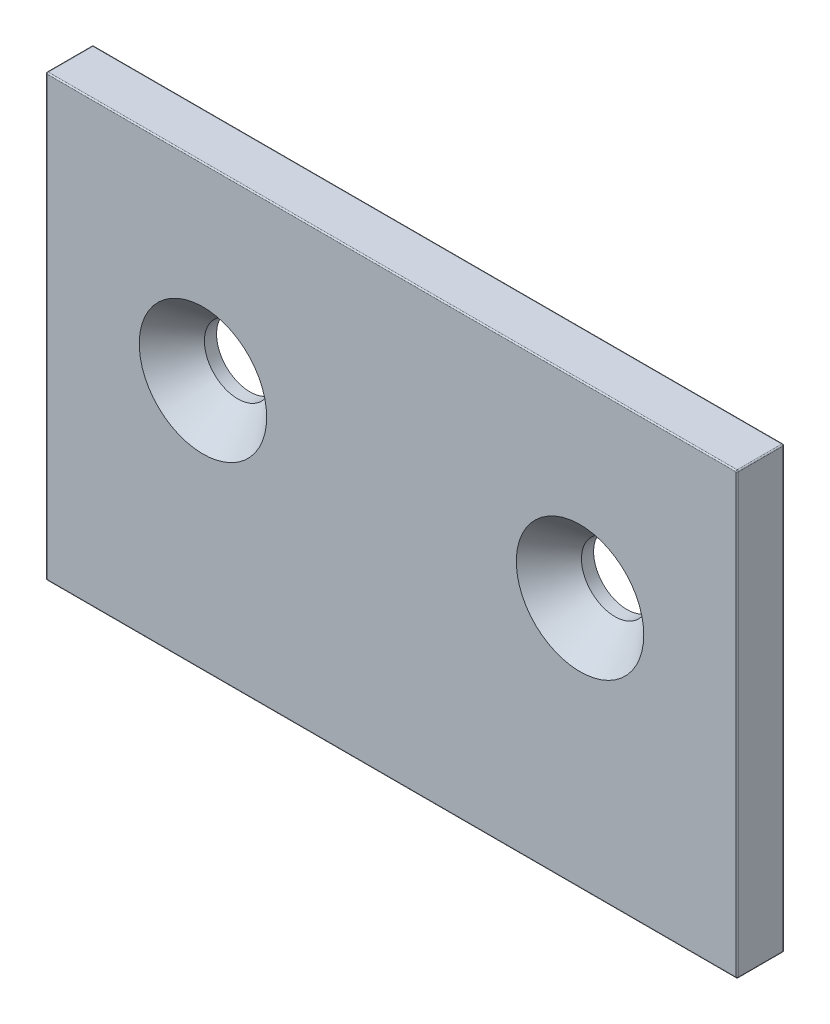
ISO-10303-21;
HEADER;
FILE_DESCRIPTION(('STEP AP214'),'2;1');
FILE_NAME('part.step','',(''),(''),'','','');
FILE_SCHEMA(('AUTOMOTIVE_DESIGN { 1 0 10303 214 1 1 1 1 }'));
ENDSEC;
DATA;
#1=APPLICATION_CONTEXT('core data for automotive mechanical design processes');
#2=APPLICATION_PROTOCOL_DEFINITION('international standard','automotive_design',2000,#1);
#3=PRODUCT_CONTEXT('',#1,'mechanical');
#4=PRODUCT('Part','Part','',(#3));
#5=PRODUCT_RELATED_PRODUCT_CATEGORY('part','',(#4));
#6=PRODUCT_DEFINITION_FORMATION('','',#4);
#7=PRODUCT_DEFINITION_CONTEXT('part definition',#1,'design');
#8=PRODUCT_DEFINITION('design','',#6,#7);
#9=PRODUCT_DEFINITION_SHAPE('','',#8);
#10=(LENGTH_UNIT() NAMED_UNIT(*) SI_UNIT(.MILLI.,.METRE.));
#11=(NAMED_UNIT(*) PLANE_ANGLE_UNIT() SI_UNIT($,.RADIAN.));
#12=(NAMED_UNIT(*) SI_UNIT($,.STERADIAN.) SOLID_ANGLE_UNIT());
#13=UNCERTAINTY_MEASURE_WITH_UNIT(LENGTH_MEASURE(1.E-05),#10,'distance_accuracy_value','');
#14=(GEOMETRIC_REPRESENTATION_CONTEXT(3) GLOBAL_UNCERTAINTY_ASSIGNED_CONTEXT((#13)) GLOBAL_UNIT_ASSIGNED_CONTEXT((#10,
#11,#12)) REPRESENTATION_CONTEXT('',''));
#15=CARTESIAN_POINT('',(0.,0.,0.));
#16=DIRECTION('',(0.,0.,1.));
#17=DIRECTION('',(1.,0.,0.));
#18=AXIS2_PLACEMENT_3D('',#15,#16,#17);
#19=CARTESIAN_POINT('',(34.925,0.,4.7498));
#20=DIRECTION('',(0.,-1.,0.));
#21=DIRECTION('',(1.,0.,0.));
#22=AXIS2_PLACEMENT_3D('',#19,#20,#21);
#23=PLANE('',#22);
#24=DIRECTION('',(-1.,0.,0.));
#25=VECTOR('',#24,1.);
#26=CARTESIAN_POINT('',(-34.925,0.,4.6228));
#27=LINE('',#26,#25);
#28=CARTESIAN_POINT('',(34.798,0.,4.6228));
#29=VERTEX_POINT('',#28);
#30=CARTESIAN_POINT('',(-34.798,0.,4.6228));
#31=VERTEX_POINT('',#30);
#32=EDGE_CURVE('E140',#29,#31,#27,.T.);
#33=ORIENTED_EDGE('',*,*,#32,.T.);
#34=DIRECTION('',(0.,0.,-1.));
#35=VECTOR('',#34,1.);
#36=CARTESIAN_POINT('',(-34.798,0.,4.7498));
#37=LINE('',#36,#35);
#38=CARTESIAN_POINT('',(-34.798,0.,0.127));
#39=VERTEX_POINT('',#38);
#40=EDGE_CURVE('E135',#31,#39,#37,.T.);
#41=ORIENTED_EDGE('',*,*,#40,.T.);
#42=DIRECTION('',(-1.,0.,0.));
#43=VECTOR('',#42,1.);
#44=CARTESIAN_POINT('',(34.925,0.,0.127));
#45=LINE('',#44,#43);
#46=CARTESIAN_POINT('',(34.798,0.,0.127));
#47=VERTEX_POINT('',#46);
#48=EDGE_CURVE('E128',#39,#47,#45,.F.);
#49=ORIENTED_EDGE('',*,*,#48,.T.);
#50=DIRECTION('',(0.,0.,-1.));
#51=VECTOR('',#50,1.);
#52=CARTESIAN_POINT('',(34.798,0.,4.7498));
#53=LINE('',#52,#51);
#54=EDGE_CURVE('E132',#47,#29,#53,.F.);
#55=ORIENTED_EDGE('',*,*,#54,.T.);
#56=EDGE_LOOP('',(#33,#41,#49,#55));
#57=FACE_BOUND('',#56,.T.);
#58=ADVANCED_FACE('F39',(#57),#23,.T.);
#59=CARTESIAN_POINT('',(34.925,0.,4.7498));
#60=DIRECTION('',(-1.,0.,0.));
#61=DIRECTION('',(0.,0.,1.));
#62=AXIS2_PLACEMENT_3D('',#59,#60,#61);
#63=PLANE('',#62);
#64=DIRECTION('',(0.,1.,0.));
#65=VECTOR('',#64,1.);
#66=CARTESIAN_POINT('',(34.925,0.,4.6228));
#67=LINE('',#66,#65);
#68=CARTESIAN_POINT('',(34.925,44.323,4.6228));
#69=VERTEX_POINT('',#68);
#70=CARTESIAN_POINT('',(34.925,0.126999999999993,4.6228));
#71=VERTEX_POINT('',#70);
#72=EDGE_CURVE('E49',#69,#71,#67,.F.);
#73=ORIENTED_EDGE('',*,*,#72,.T.);
#74=DIRECTION('',(0.,0.,-1.));
#75=VECTOR('',#74,1.);
#76=CARTESIAN_POINT('',(34.925,0.126999999999993,0.));
#77=LINE('',#76,#75);
#78=CARTESIAN_POINT('',(34.925,0.126999999999993,0.127));
#79=VERTEX_POINT('',#78);
#80=EDGE_CURVE('E11',#71,#79,#77,.T.);
#81=ORIENTED_EDGE('',*,*,#80,.T.);
#82=DIRECTION('',(0.,1.,0.));
#83=VECTOR('',#82,1.);
#84=CARTESIAN_POINT('',(34.925,44.45,0.127));
#85=LINE('',#84,#83);
#86=CARTESIAN_POINT('',(34.925,44.323,0.127));
#87=VERTEX_POINT('',#86);
#88=EDGE_CURVE('E231',#79,#87,#85,.T.);
#89=ORIENTED_EDGE('',*,*,#88,.T.);
#90=DIRECTION('',(0.,0.,-1.));
#91=VECTOR('',#90,1.);
#92=CARTESIAN_POINT('',(34.925,44.323,4.7498));
#93=LINE('',#92,#91);
#94=EDGE_CURVE('E60',#87,#69,#93,.F.);
#95=ORIENTED_EDGE('',*,*,#94,.T.);
#96=EDGE_LOOP('',(#73,#81,#89,#95));
#97=FACE_BOUND('',#96,.T.);
#98=ADVANCED_FACE('F366',(#97),#63,.F.);
#99=CARTESIAN_POINT('',(34.925,44.45,4.7498));
#100=DIRECTION('',(0.,-1.,0.));
#101=DIRECTION('',(0.,0.,-1.));
#102=AXIS2_PLACEMENT_3D('',#99,#100,#101);
#103=PLANE('',#102);
#104=DIRECTION('',(0.,0.,-1.));
#105=VECTOR('',#104,1.);
#106=CARTESIAN_POINT('',(-34.798,44.45,4.7498));
#107=LINE('',#106,#105);
#108=CARTESIAN_POINT('',(-34.798,44.45,0.127));
#109=VERTEX_POINT('',#108);
#110=CARTESIAN_POINT('',(-34.798,44.45,4.6228));
#111=VERTEX_POINT('',#110);
#112=EDGE_CURVE('E224',#109,#111,#107,.F.);
#113=ORIENTED_EDGE('',*,*,#112,.T.);
#114=DIRECTION('',(-1.,0.,0.));
#115=VECTOR('',#114,1.);
#116=CARTESIAN_POINT('',(34.925,44.45,4.6228));
#117=LINE('',#116,#115);
#118=CARTESIAN_POINT('',(34.798,44.45,4.6228));
#119=VERTEX_POINT('',#118);
#120=EDGE_CURVE('E227',#111,#119,#117,.F.);
#121=ORIENTED_EDGE('',*,*,#120,.T.);
#122=DIRECTION('',(0.,0.,-1.));
#123=VECTOR('',#122,1.);
#124=CARTESIAN_POINT('',(34.798,44.45,4.7498));
#125=LINE('',#124,#123);
#126=CARTESIAN_POINT('',(34.798,44.45,0.127));
#127=VERTEX_POINT('',#126);
#128=EDGE_CURVE('E218',#119,#127,#125,.T.);
#129=ORIENTED_EDGE('',*,*,#128,.T.);
#130=DIRECTION('',(-1.,0.,0.));
#131=VECTOR('',#130,1.);
#132=CARTESIAN_POINT('',(-34.925,44.45,0.127));
#133=LINE('',#132,#131);
#134=EDGE_CURVE('E221',#127,#109,#133,.T.);
#135=ORIENTED_EDGE('',*,*,#134,.T.);
#136=EDGE_LOOP('',(#113,#121,#129,#135));
#137=FACE_BOUND('',#136,.T.);
#138=ADVANCED_FACE('F360',(#137),#103,.F.);
#139=CARTESIAN_POINT('',(-34.925,0.,4.7498));
#140=DIRECTION('',(-1.,0.,0.));
#141=DIRECTION('',(0.,0.,1.));
#142=AXIS2_PLACEMENT_3D('',#139,#140,#141);
#143=PLANE('',#142);
#144=DIRECTION('',(0.,0.,-1.));
#145=VECTOR('',#144,1.);
#146=CARTESIAN_POINT('',(-34.925,0.127,4.7498));
#147=LINE('',#146,#145);
#148=CARTESIAN_POINT('',(-34.925,0.127,0.127));
#149=VERTEX_POINT('',#148);
#150=CARTESIAN_POINT('',(-34.925,0.127,4.6228));
#151=VERTEX_POINT('',#150);
#152=EDGE_CURVE('E211',#149,#151,#147,.F.);
#153=ORIENTED_EDGE('',*,*,#152,.T.);
#154=DIRECTION('',(0.,1.,0.));
#155=VECTOR('',#154,1.);
#156=CARTESIAN_POINT('',(-34.925,44.45,4.6228));
#157=LINE('',#156,#155);
#158=CARTESIAN_POINT('',(-34.925,44.323,4.6228));
#159=VERTEX_POINT('',#158);
#160=EDGE_CURVE('E214',#151,#159,#157,.T.);
#161=ORIENTED_EDGE('',*,*,#160,.T.);
#162=DIRECTION('',(0.,0.,-1.));
#163=VECTOR('',#162,1.);
#164=CARTESIAN_POINT('',(-34.925,44.323,0.));
#165=LINE('',#164,#163);
#166=CARTESIAN_POINT('',(-34.925,44.323,0.127));
#167=VERTEX_POINT('',#166);
#168=EDGE_CURVE('E205',#159,#167,#165,.T.);
#169=ORIENTED_EDGE('',*,*,#168,.T.);
#170=DIRECTION('',(0.,1.,0.));
#171=VECTOR('',#170,1.);
#172=CARTESIAN_POINT('',(-34.925,0.,0.127));
#173=LINE('',#172,#171);
#174=EDGE_CURVE('E208',#167,#149,#173,.F.);
#175=ORIENTED_EDGE('',*,*,#174,.T.);
#176=EDGE_LOOP('',(#153,#161,#169,#175));
#177=FACE_BOUND('',#176,.T.);
#178=ADVANCED_FACE('F351',(#177),#143,.T.);
#179=CARTESIAN_POINT('',(0.,0.,4.7498));
#180=DIRECTION('',(0.,0.,-1.));
#181=DIRECTION('',(-1.,0.,0.));
#182=AXIS2_PLACEMENT_3D('',#179,#180,#181);
#183=PLANE('',#182);
#184=DIRECTION('',(0.,1.,0.));
#185=VECTOR('',#184,1.);
#186=CARTESIAN_POINT('',(-34.798,0.,4.7498));
#187=LINE('',#186,#185);
#188=CARTESIAN_POINT('',(-34.798,44.323,4.7498));
#189=VERTEX_POINT('',#188);
#190=CARTESIAN_POINT('',(-34.798,0.127,4.7498));
#191=VERTEX_POINT('',#190);
#192=EDGE_CURVE('E187',#189,#191,#187,.F.);
#193=ORIENTED_EDGE('',*,*,#192,.T.);
#194=DIRECTION('',(-1.,0.,0.));
#195=VECTOR('',#194,1.);
#196=CARTESIAN_POINT('',(34.925,0.126999999999992,4.7498));
#197=LINE('',#196,#195);
#198=CARTESIAN_POINT('',(34.798,0.126999999999993,4.7498));
#199=VERTEX_POINT('',#198);
#200=EDGE_CURVE('E190',#191,#199,#197,.F.);
#201=ORIENTED_EDGE('',*,*,#200,.T.);
#202=DIRECTION('',(0.,1.,0.));
#203=VECTOR('',#202,1.);
#204=CARTESIAN_POINT('',(34.798,0.,4.7498));
#205=LINE('',#204,#203);
#206=CARTESIAN_POINT('',(34.798,44.323,4.7498));
#207=VERTEX_POINT('',#206);
#208=EDGE_CURVE('E181',#199,#207,#205,.T.);
#209=ORIENTED_EDGE('',*,*,#208,.T.);
#210=DIRECTION('',(-1.,0.,0.));
#211=VECTOR('',#210,1.);
#212=CARTESIAN_POINT('',(0.,44.323,4.7498));
#213=LINE('',#212,#211);
#214=EDGE_CURVE('E184',#207,#189,#213,.T.);
#215=ORIENTED_EDGE('',*,*,#214,.T.);
#216=EDGE_LOOP('',(#193,#201,#209,#215));
#217=FACE_BOUND('',#216,.T.);
#218=CARTESIAN_POINT('',(-19.05,25.4,4.7498));
#219=DIRECTION('',(0.,0.,1.));
#220=DIRECTION('',(1.,0.,0.));
#221=AXIS2_PLACEMENT_3D('',#218,#219,#220);
#222=CIRCLE('',#221,6.4389);
#223=CARTESIAN_POINT('',(-12.6111,25.4,4.7498));
#224=VERTEX_POINT('',#223);
#225=EDGE_CURVE('E313',#224,#224,#222,.T.);
#226=ORIENTED_EDGE('',*,*,#225,.F.);
#227=EDGE_LOOP('',(#226));
#228=FACE_BOUND('',#227,.T.);
#229=CARTESIAN_POINT('',(19.05,25.4,4.7498));
#230=DIRECTION('',(0.,0.,1.));
#231=DIRECTION('',(1.,0.,0.));
#232=AXIS2_PLACEMENT_3D('',#229,#230,#231);
#233=CIRCLE('',#232,6.4389);
#234=CARTESIAN_POINT('',(25.4889,25.4,4.7498));
#235=VERTEX_POINT('',#234);
#236=EDGE_CURVE('E332',#235,#235,#233,.T.);
#237=ORIENTED_EDGE('',*,*,#236,.F.);
#238=EDGE_LOOP('',(#237));
#239=FACE_BOUND('',#238,.T.);
#240=ADVANCED_FACE('F348',(#217,#228,#239),#183,.F.);
#241=CARTESIAN_POINT('',(0.,0.,0.));
#242=DIRECTION('',(0.,0.,-1.));
#243=DIRECTION('',(-1.,0.,0.));
#244=AXIS2_PLACEMENT_3D('',#241,#242,#243);
#245=PLANE('',#244);
#246=DIRECTION('',(0.,1.,0.));
#247=VECTOR('',#246,1.);
#248=CARTESIAN_POINT('',(34.798,0.,0.));
#249=LINE('',#248,#247);
#250=CARTESIAN_POINT('',(34.798,44.323,0.));
#251=VERTEX_POINT('',#250);
#252=CARTESIAN_POINT('',(34.798,0.126999999999992,0.));
#253=VERTEX_POINT('',#252);
#254=EDGE_CURVE('E194',#251,#253,#249,.F.);
#255=ORIENTED_EDGE('',*,*,#254,.T.);
#256=DIRECTION('',(-1.,0.,0.));
#257=VECTOR('',#256,1.);
#258=CARTESIAN_POINT('',(0.,0.126999999999996,0.));
#259=LINE('',#258,#257);
#260=CARTESIAN_POINT('',(-34.798,0.127,0.));
#261=VERTEX_POINT('',#260);
#262=EDGE_CURVE('E148',#253,#261,#259,.T.);
#263=ORIENTED_EDGE('',*,*,#262,.T.);
#264=DIRECTION('',(0.,1.,0.));
#265=VECTOR('',#264,1.);
#266=CARTESIAN_POINT('',(-34.798,0.,0.));
#267=LINE('',#266,#265);
#268=CARTESIAN_POINT('',(-34.798,44.323,0.));
#269=VERTEX_POINT('',#268);
#270=EDGE_CURVE('E200',#261,#269,#267,.T.);
#271=ORIENTED_EDGE('',*,*,#270,.T.);
#272=DIRECTION('',(-1.,0.,0.));
#273=VECTOR('',#272,1.);
#274=CARTESIAN_POINT('',(34.925,44.323,0.));
#275=LINE('',#274,#273);
#276=EDGE_CURVE('E197',#269,#251,#275,.F.);
#277=ORIENTED_EDGE('',*,*,#276,.T.);
#278=EDGE_LOOP('',(#255,#263,#271,#277));
#279=FACE_BOUND('',#278,.T.);
#280=CARTESIAN_POINT('',(-19.05,25.4,0.));
#281=DIRECTION('',(0.,0.,1.));
#282=DIRECTION('',(1.,0.,0.));
#283=AXIS2_PLACEMENT_3D('',#280,#281,#282);
#284=CIRCLE('',#283,3.3782);
#285=CARTESIAN_POINT('',(-15.6718,25.4,0.));
#286=VERTEX_POINT('',#285);
#287=EDGE_CURVE('E326',#286,#286,#284,.T.);
#288=ORIENTED_EDGE('',*,*,#287,.T.);
#289=EDGE_LOOP('',(#288));
#290=FACE_BOUND('',#289,.T.);
#291=CARTESIAN_POINT('',(19.05,25.4,0.));
#292=DIRECTION('',(0.,0.,1.));
#293=DIRECTION('',(1.,0.,0.));
#294=AXIS2_PLACEMENT_3D('',#291,#292,#293);
#295=CIRCLE('',#294,3.3782);
#296=CARTESIAN_POINT('',(22.4282,25.4,0.));
#297=VERTEX_POINT('',#296);
#298=EDGE_CURVE('E169',#297,#297,#295,.T.);
#299=ORIENTED_EDGE('',*,*,#298,.T.);
#300=EDGE_LOOP('',(#299));
#301=FACE_BOUND('',#300,.T.);
#302=ADVANCED_FACE('F350',(#279,#290,#301),#245,.T.);
#303=CARTESIAN_POINT('',(19.05,25.4,4.7498));
#304=DIRECTION('',(0.,0.,1.));
#305=DIRECTION('',(1.,0.,0.));
#306=AXIS2_PLACEMENT_3D('',#303,#304,#305);
#307=CYLINDRICAL_SURFACE('',#306,3.3782);
#308=ORIENTED_EDGE('',*,*,#298,.F.);
#309=EDGE_LOOP('',(#308));
#310=FACE_BOUND('',#309,.T.);
#311=CARTESIAN_POINT('',(19.05,25.4,1.22886741601866));
#312=DIRECTION('',(0.,0.,1.));
#313=DIRECTION('',(1.,0.,0.));
#314=AXIS2_PLACEMENT_3D('',#311,#312,#313);
#315=CIRCLE('',#314,3.3782);
#316=CARTESIAN_POINT('',(22.4282,25.4,1.22886741601866));
#317=VERTEX_POINT('',#316);
#318=EDGE_CURVE('E173',#317,#317,#315,.T.);
#319=ORIENTED_EDGE('',*,*,#318,.T.);
#320=EDGE_LOOP('',(#319));
#321=FACE_BOUND('',#320,.T.);
#322=ADVANCED_FACE('F339',(#310,#321),#307,.F.);
#323=CARTESIAN_POINT('',(19.05,25.4,4.7498));
#324=DIRECTION('',(0.,0.,1.));
#325=DIRECTION('',(1.,0.,0.));
#326=AXIS2_PLACEMENT_3D('',#323,#324,#325);
#327=CONICAL_SURFACE('',#326,6.4389,0.715584993317676);
#328=ORIENTED_EDGE('',*,*,#318,.F.);
#329=EDGE_LOOP('',(#328));
#330=FACE_BOUND('',#329,.T.);
#331=ORIENTED_EDGE('',*,*,#236,.T.);
#332=EDGE_LOOP('',(#331));
#333=FACE_BOUND('',#332,.T.);
#334=ADVANCED_FACE('F341',(#330,#333),#327,.F.);
#335=CARTESIAN_POINT('',(-19.05,25.4,4.7498));
#336=DIRECTION('',(0.,0.,1.));
#337=DIRECTION('',(1.,0.,0.));
#338=AXIS2_PLACEMENT_3D('',#335,#336,#337);
#339=CYLINDRICAL_SURFACE('',#338,3.3782);
#340=ORIENTED_EDGE('',*,*,#287,.F.);
#341=EDGE_LOOP('',(#340));
#342=FACE_BOUND('',#341,.T.);
#343=CARTESIAN_POINT('',(-19.05,25.4,1.22886741601866));
#344=DIRECTION('',(0.,0.,1.));
#345=DIRECTION('',(1.,0.,0.));
#346=AXIS2_PLACEMENT_3D('',#343,#344,#345);
#347=CIRCLE('',#346,3.3782);
#348=CARTESIAN_POINT('',(-15.6718,25.4,1.22886741601866));
#349=VERTEX_POINT('',#348);
#350=EDGE_CURVE('E320',#349,#349,#347,.T.);
#351=ORIENTED_EDGE('',*,*,#350,.T.);
#352=EDGE_LOOP('',(#351));
#353=FACE_BOUND('',#352,.T.);
#354=ADVANCED_FACE('F344',(#342,#353),#339,.F.);
#355=CARTESIAN_POINT('',(-19.05,25.4,4.7498));
#356=DIRECTION('',(0.,0.,1.));
#357=DIRECTION('',(1.,0.,0.));
#358=AXIS2_PLACEMENT_3D('',#355,#356,#357);
#359=CONICAL_SURFACE('',#358,6.4389,0.715584993317676);
#360=ORIENTED_EDGE('',*,*,#350,.F.);
#361=EDGE_LOOP('',(#360));
#362=FACE_BOUND('',#361,.T.);
#363=ORIENTED_EDGE('',*,*,#225,.T.);
#364=EDGE_LOOP('',(#363));
#365=FACE_BOUND('',#364,.T.);
#366=ADVANCED_FACE('F443',(#362,#365),#359,.F.);
#367=CARTESIAN_POINT('',(34.925,44.323,0.127));
#368=DIRECTION('',(1.,0.,0.));
#369=DIRECTION('',(0.,0.,-1.));
#370=AXIS2_PLACEMENT_3D('',#367,#368,#369);
#371=CYLINDRICAL_SURFACE('',#370,0.127);
#372=CARTESIAN_POINT('',(34.798,44.323,0.127));
#373=DIRECTION('',(1.,0.,0.));
#374=DIRECTION('',(0.,0.,-1.));
#375=AXIS2_PLACEMENT_3D('',#372,#373,#374);
#376=CIRCLE('',#375,0.127);
#377=EDGE_CURVE('E43',#251,#127,#376,.T.);
#378=ORIENTED_EDGE('',*,*,#377,.F.);
#379=ORIENTED_EDGE('',*,*,#276,.F.);
#380=CARTESIAN_POINT('',(-34.798,44.323,0.127));
#381=DIRECTION('',(-1.,0.,0.));
#382=DIRECTION('',(0.,0.,1.));
#383=AXIS2_PLACEMENT_3D('',#380,#381,#382);
#384=CIRCLE('',#383,0.127);
#385=EDGE_CURVE('E304',#109,#269,#384,.T.);
#386=ORIENTED_EDGE('',*,*,#385,.F.);
#387=ORIENTED_EDGE('',*,*,#134,.F.);
#388=EDGE_LOOP('',(#378,#379,#386,#387));
#389=FACE_BOUND('',#388,.T.);
#390=ADVANCED_FACE('F41',(#389),#371,.T.);
#391=CARTESIAN_POINT('',(34.798,44.323,0.127));
#392=DIRECTION('',(0.,1.,0.));
#393=DIRECTION('',(0.,0.,1.));
#394=AXIS2_PLACEMENT_3D('',#391,#392,#393);
#395=SPHERICAL_SURFACE('',#394,0.127);
#396=CARTESIAN_POINT('',(34.798,44.323,0.127));
#397=DIRECTION('',(0.,1.,0.));
#398=DIRECTION('',(0.,0.,1.));
#399=AXIS2_PLACEMENT_3D('',#396,#397,#398);
#400=CIRCLE('',#399,0.127);
#401=EDGE_CURVE('E297',#251,#87,#400,.F.);
#402=ORIENTED_EDGE('',*,*,#401,.F.);
#403=ORIENTED_EDGE('',*,*,#377,.T.);
#404=CARTESIAN_POINT('',(34.798,44.323,0.127));
#405=DIRECTION('',(0.,0.,-1.));
#406=DIRECTION('',(-1.,0.,0.));
#407=AXIS2_PLACEMENT_3D('',#404,#405,#406);
#408=CIRCLE('',#407,0.127);
#409=EDGE_CURVE('E301',#87,#127,#408,.F.);
#410=ORIENTED_EDGE('',*,*,#409,.F.);
#411=EDGE_LOOP('',(#402,#403,#410));
#412=FACE_BOUND('',#411,.T.);
#413=ADVANCED_FACE('F438',(#412),#395,.T.);
#414=CARTESIAN_POINT('',(-34.798,44.323,0.127));
#415=DIRECTION('',(0.,0.,-1.));
#416=DIRECTION('',(-1.,0.,0.));
#417=AXIS2_PLACEMENT_3D('',#414,#415,#416);
#418=SPHERICAL_SURFACE('',#417,0.127);
#419=CARTESIAN_POINT('',(-34.798,44.323,0.127));
#420=DIRECTION('',(0.,0.,-1.));
#421=DIRECTION('',(0.,1.,0.));
#422=AXIS2_PLACEMENT_3D('',#419,#420,#421);
#423=CIRCLE('',#422,0.127);
#424=EDGE_CURVE('E289',#109,#167,#423,.F.);
#425=ORIENTED_EDGE('',*,*,#424,.F.);
#426=ORIENTED_EDGE('',*,*,#385,.T.);
#427=CARTESIAN_POINT('',(-34.798,44.323,0.127));
#428=DIRECTION('',(0.,1.,0.));
#429=DIRECTION('',(0.,0.,1.));
#430=AXIS2_PLACEMENT_3D('',#427,#428,#429);
#431=CIRCLE('',#430,0.127);
#432=EDGE_CURVE('E293',#167,#269,#431,.F.);
#433=ORIENTED_EDGE('',*,*,#432,.F.);
#434=EDGE_LOOP('',(#425,#426,#433));
#435=FACE_BOUND('',#434,.T.);
#436=ADVANCED_FACE('F435',(#435),#418,.T.);
#437=CARTESIAN_POINT('',(34.798,44.323,4.7498));
#438=DIRECTION('',(0.,0.,-1.));
#439=DIRECTION('',(-1.,0.,0.));
#440=AXIS2_PLACEMENT_3D('',#437,#438,#439);
#441=CYLINDRICAL_SURFACE('',#440,0.127);
#442=ORIENTED_EDGE('',*,*,#409,.T.);
#443=ORIENTED_EDGE('',*,*,#128,.F.);
#444=CARTESIAN_POINT('',(34.798,44.323,4.6228));
#445=DIRECTION('',(0.,0.,1.));
#446=DIRECTION('',(1.,0.,0.));
#447=AXIS2_PLACEMENT_3D('',#444,#445,#446);
#448=CIRCLE('',#447,0.127);
#449=EDGE_CURVE('E282',#69,#119,#448,.T.);
#450=ORIENTED_EDGE('',*,*,#449,.F.);
#451=ORIENTED_EDGE('',*,*,#94,.F.);
#452=EDGE_LOOP('',(#442,#443,#450,#451));
#453=FACE_BOUND('',#452,.T.);
#454=ADVANCED_FACE('F431',(#453),#441,.T.);
#455=CARTESIAN_POINT('',(34.798,0.,0.127));
#456=DIRECTION('',(0.,-1.,0.));
#457=DIRECTION('',(0.,0.,-1.));
#458=AXIS2_PLACEMENT_3D('',#455,#456,#457);
#459=CYLINDRICAL_SURFACE('',#458,0.127);
#460=ORIENTED_EDGE('',*,*,#401,.T.);
#461=ORIENTED_EDGE('',*,*,#88,.F.);
#462=CARTESIAN_POINT('',(34.798,0.126999999999992,0.127));
#463=DIRECTION('',(0.,-1.,0.));
#464=DIRECTION('',(1.,0.,0.));
#465=AXIS2_PLACEMENT_3D('',#462,#463,#464);
#466=CIRCLE('',#465,0.127);
#467=EDGE_CURVE('E153',#253,#79,#466,.T.);
#468=ORIENTED_EDGE('',*,*,#467,.F.);
#469=ORIENTED_EDGE('',*,*,#254,.F.);
#470=EDGE_LOOP('',(#460,#461,#468,#469));
#471=FACE_BOUND('',#470,.T.);
#472=ADVANCED_FACE('F428',(#471),#459,.T.);
#473=CARTESIAN_POINT('',(0.,0.126999999999996,0.127));
#474=DIRECTION('',(-1.,0.,0.));
#475=DIRECTION('',(0.,-1.,0.));
#476=AXIS2_PLACEMENT_3D('',#473,#474,#475);
#477=CYLINDRICAL_SURFACE('',#476,0.127);
#478=CARTESIAN_POINT('',(-34.798,0.127,0.127));
#479=DIRECTION('',(-1.,0.,0.));
#480=DIRECTION('',(0.,0.,1.));
#481=AXIS2_PLACEMENT_3D('',#478,#479,#480);
#482=CIRCLE('',#481,0.127);
#483=EDGE_CURVE('E154',#261,#39,#482,.T.);
#484=ORIENTED_EDGE('',*,*,#483,.F.);
#485=ORIENTED_EDGE('',*,*,#262,.F.);
#486=CARTESIAN_POINT('',(34.798,0.126999999999993,0.127));
#487=DIRECTION('',(1.,0.,0.));
#488=DIRECTION('',(0.,0.,-1.));
#489=AXIS2_PLACEMENT_3D('',#486,#487,#488);
#490=CIRCLE('',#489,0.127);
#491=EDGE_CURVE('E144',#47,#253,#490,.T.);
#492=ORIENTED_EDGE('',*,*,#491,.F.);
#493=ORIENTED_EDGE('',*,*,#48,.F.);
#494=EDGE_LOOP('',(#484,#485,#492,#493));
#495=FACE_BOUND('',#494,.T.);
#496=ADVANCED_FACE('F146',(#495),#477,.T.);
#497=CARTESIAN_POINT('',(-34.798,0.,0.127));
#498=DIRECTION('',(0.,1.,0.));
#499=DIRECTION('',(0.,0.,1.));
#500=AXIS2_PLACEMENT_3D('',#497,#498,#499);
#501=CYLINDRICAL_SURFACE('',#500,0.127);
#502=ORIENTED_EDGE('',*,*,#432,.T.);
#503=ORIENTED_EDGE('',*,*,#270,.F.);
#504=CARTESIAN_POINT('',(-34.798,0.127,0.127));
#505=DIRECTION('',(0.,-1.,0.));
#506=DIRECTION('',(0.,0.,-1.));
#507=AXIS2_PLACEMENT_3D('',#504,#505,#506);
#508=CIRCLE('',#507,0.127);
#509=EDGE_CURVE('E275',#149,#261,#508,.T.);
#510=ORIENTED_EDGE('',*,*,#509,.F.);
#511=ORIENTED_EDGE('',*,*,#174,.F.);
#512=EDGE_LOOP('',(#502,#503,#510,#511));
#513=FACE_BOUND('',#512,.T.);
#514=ADVANCED_FACE('F421',(#513),#501,.T.);
#515=CARTESIAN_POINT('',(-34.798,44.323,4.7498));
#516=DIRECTION('',(0.,0.,1.));
#517=DIRECTION('',(1.,0.,0.));
#518=AXIS2_PLACEMENT_3D('',#515,#516,#517);
#519=CYLINDRICAL_SURFACE('',#518,0.127);
#520=ORIENTED_EDGE('',*,*,#424,.T.);
#521=ORIENTED_EDGE('',*,*,#168,.F.);
#522=CARTESIAN_POINT('',(-34.798,44.323,4.6228));
#523=DIRECTION('',(0.,0.,1.));
#524=DIRECTION('',(1.,0.,0.));
#525=AXIS2_PLACEMENT_3D('',#522,#523,#524);
#526=CIRCLE('',#525,0.127);
#527=EDGE_CURVE('E271',#111,#159,#526,.T.);
#528=ORIENTED_EDGE('',*,*,#527,.F.);
#529=ORIENTED_EDGE('',*,*,#112,.F.);
#530=EDGE_LOOP('',(#520,#521,#528,#529));
#531=FACE_BOUND('',#530,.T.);
#532=ADVANCED_FACE('F417',(#531),#519,.T.);
#533=CARTESIAN_POINT('',(0.,44.323,4.6228));
#534=DIRECTION('',(-1.,0.,0.));
#535=DIRECTION('',(0.,0.,1.));
#536=AXIS2_PLACEMENT_3D('',#533,#534,#535);
#537=CYLINDRICAL_SURFACE('',#536,0.127);
#538=CARTESIAN_POINT('',(34.798,44.323,4.6228));
#539=DIRECTION('',(1.,0.,0.));
#540=DIRECTION('',(0.,0.,-1.));
#541=AXIS2_PLACEMENT_3D('',#538,#539,#540);
#542=CIRCLE('',#541,0.127);
#543=EDGE_CURVE('E285',#119,#207,#542,.T.);
#544=ORIENTED_EDGE('',*,*,#543,.F.);
#545=ORIENTED_EDGE('',*,*,#120,.F.);
#546=CARTESIAN_POINT('',(-34.798,44.323,4.6228));
#547=DIRECTION('',(-1.,0.,0.));
#548=DIRECTION('',(0.,0.,1.));
#549=AXIS2_PLACEMENT_3D('',#546,#547,#548);
#550=CIRCLE('',#549,0.127);
#551=EDGE_CURVE('E267',#189,#111,#550,.T.);
#552=ORIENTED_EDGE('',*,*,#551,.F.);
#553=ORIENTED_EDGE('',*,*,#214,.F.);
#554=EDGE_LOOP('',(#544,#545,#552,#553));
#555=FACE_BOUND('',#554,.T.);
#556=ADVANCED_FACE('F413',(#555),#537,.T.);
#557=CARTESIAN_POINT('',(34.798,44.323,4.6228));
#558=DIRECTION('',(0.,1.,0.));
#559=DIRECTION('',(0.,0.,1.));
#560=AXIS2_PLACEMENT_3D('',#557,#558,#559);
#561=SPHERICAL_SURFACE('',#560,0.127);
#562=ORIENTED_EDGE('',*,*,#449,.T.);
#563=ORIENTED_EDGE('',*,*,#543,.T.);
#564=CARTESIAN_POINT('',(34.798,44.323,4.6228));
#565=DIRECTION('',(0.,1.,0.));
#566=DIRECTION('',(0.,0.,1.));
#567=AXIS2_PLACEMENT_3D('',#564,#565,#566);
#568=CIRCLE('',#567,0.127);
#569=EDGE_CURVE('E161',#69,#207,#568,.F.);
#570=ORIENTED_EDGE('',*,*,#569,.F.);
#571=EDGE_LOOP('',(#562,#563,#570));
#572=FACE_BOUND('',#571,.T.);
#573=ADVANCED_FACE('F410',(#572),#561,.T.);
#574=CARTESIAN_POINT('',(34.798,0.126999999999993,0.127));
#575=DIRECTION('',(0.,0.,-1.));
#576=DIRECTION('',(0.,1.,0.));
#577=AXIS2_PLACEMENT_3D('',#574,#575,#576);
#578=SPHERICAL_SURFACE('',#577,0.127);
#579=ORIENTED_EDGE('',*,*,#491,.T.);
#580=ORIENTED_EDGE('',*,*,#467,.T.);
#581=CARTESIAN_POINT('',(34.798,0.126999999999993,0.127));
#582=DIRECTION('',(0.,0.,-1.));
#583=DIRECTION('',(0.,1.,0.));
#584=AXIS2_PLACEMENT_3D('',#581,#582,#583);
#585=CIRCLE('',#584,0.127);
#586=EDGE_CURVE('E156',#47,#79,#585,.F.);
#587=ORIENTED_EDGE('',*,*,#586,.F.);
#588=EDGE_LOOP('',(#579,#580,#587));
#589=FACE_BOUND('',#588,.T.);
#590=ADVANCED_FACE('F157',(#589),#578,.T.);
#591=CARTESIAN_POINT('',(-34.798,0.127,0.127));
#592=DIRECTION('',(0.,0.,-1.));
#593=DIRECTION('',(0.,1.,0.));
#594=AXIS2_PLACEMENT_3D('',#591,#592,#593);
#595=SPHERICAL_SURFACE('',#594,0.127);
#596=ORIENTED_EDGE('',*,*,#509,.T.);
#597=ORIENTED_EDGE('',*,*,#483,.T.);
#598=CARTESIAN_POINT('',(-34.798,0.127,0.127));
#599=DIRECTION('',(0.,0.,-1.));
#600=DIRECTION('',(-1.,0.,0.));
#601=AXIS2_PLACEMENT_3D('',#598,#599,#600);
#602=CIRCLE('',#601,0.127);
#603=EDGE_CURVE('E162',#149,#39,#602,.F.);
#604=ORIENTED_EDGE('',*,*,#603,.F.);
#605=EDGE_LOOP('',(#596,#597,#604));
#606=FACE_BOUND('',#605,.T.);
#607=ADVANCED_FACE('F403',(#606),#595,.T.);
#608=CARTESIAN_POINT('',(-34.798,44.323,4.6228));
#609=DIRECTION('',(0.,1.,0.));
#610=DIRECTION('',(0.,0.,1.));
#611=AXIS2_PLACEMENT_3D('',#608,#609,#610);
#612=SPHERICAL_SURFACE('',#611,0.127);
#613=ORIENTED_EDGE('',*,*,#551,.T.);
#614=ORIENTED_EDGE('',*,*,#527,.T.);
#615=CARTESIAN_POINT('',(-34.798,44.323,4.6228));
#616=DIRECTION('',(0.,1.,0.));
#617=DIRECTION('',(0.,0.,1.));
#618=AXIS2_PLACEMENT_3D('',#615,#616,#617);
#619=CIRCLE('',#618,0.127);
#620=EDGE_CURVE('E258',#189,#159,#619,.F.);
#621=ORIENTED_EDGE('',*,*,#620,.F.);
#622=EDGE_LOOP('',(#613,#614,#621));
#623=FACE_BOUND('',#622,.T.);
#624=ADVANCED_FACE('F399',(#623),#612,.T.);
#625=CARTESIAN_POINT('',(34.798,0.,4.6228));
#626=DIRECTION('',(0.,1.,0.));
#627=DIRECTION('',(0.,0.,1.));
#628=AXIS2_PLACEMENT_3D('',#625,#626,#627);
#629=CYLINDRICAL_SURFACE('',#628,0.127);
#630=ORIENTED_EDGE('',*,*,#569,.T.);
#631=ORIENTED_EDGE('',*,*,#208,.F.);
#632=CARTESIAN_POINT('',(34.798,0.126999999999993,4.6228));
#633=DIRECTION('',(0.,-1.,0.));
#634=DIRECTION('',(0.,0.,-1.));
#635=AXIS2_PLACEMENT_3D('',#632,#633,#634);
#636=CIRCLE('',#635,0.127);
#637=EDGE_CURVE('E254',#71,#199,#636,.T.);
#638=ORIENTED_EDGE('',*,*,#637,.F.);
#639=ORIENTED_EDGE('',*,*,#72,.F.);
#640=EDGE_LOOP('',(#630,#631,#638,#639));
#641=FACE_BOUND('',#640,.T.);
#642=ADVANCED_FACE('F396',(#641),#629,.T.);
#643=CARTESIAN_POINT('',(34.798,0.126999999999993,4.7498));
#644=DIRECTION('',(0.,0.,1.));
#645=DIRECTION('',(1.,0.,0.));
#646=AXIS2_PLACEMENT_3D('',#643,#644,#645);
#647=CYLINDRICAL_SURFACE('',#646,0.127);
#648=ORIENTED_EDGE('',*,*,#586,.T.);
#649=ORIENTED_EDGE('',*,*,#80,.F.);
#650=CARTESIAN_POINT('',(34.798,0.126999999999993,4.6228));
#651=DIRECTION('',(0.,0.,1.));
#652=DIRECTION('',(1.,0.,0.));
#653=AXIS2_PLACEMENT_3D('',#650,#651,#652);
#654=CIRCLE('',#653,0.127);
#655=EDGE_CURVE('E166',#29,#71,#654,.T.);
#656=ORIENTED_EDGE('',*,*,#655,.F.);
#657=ORIENTED_EDGE('',*,*,#54,.F.);
#658=EDGE_LOOP('',(#648,#649,#656,#657));
#659=FACE_BOUND('',#658,.T.);
#660=ADVANCED_FACE('F164',(#659),#647,.T.);
#661=CARTESIAN_POINT('',(-34.798,0.127,4.7498));
#662=DIRECTION('',(0.,0.,-1.));
#663=DIRECTION('',(-1.,0.,0.));
#664=AXIS2_PLACEMENT_3D('',#661,#662,#663);
#665=CYLINDRICAL_SURFACE('',#664,0.127);
#666=ORIENTED_EDGE('',*,*,#603,.T.);
#667=ORIENTED_EDGE('',*,*,#40,.F.);
#668=CARTESIAN_POINT('',(-34.798,0.127,4.6228));
#669=DIRECTION('',(0.,0.,1.));
#670=DIRECTION('',(1.,0.,0.));
#671=AXIS2_PLACEMENT_3D('',#668,#669,#670);
#672=CIRCLE('',#671,0.127);
#673=EDGE_CURVE('E248',#151,#31,#672,.T.);
#674=ORIENTED_EDGE('',*,*,#673,.F.);
#675=ORIENTED_EDGE('',*,*,#152,.F.);
#676=EDGE_LOOP('',(#666,#667,#674,#675));
#677=FACE_BOUND('',#676,.T.);
#678=ADVANCED_FACE('F389',(#677),#665,.T.);
#679=CARTESIAN_POINT('',(-34.798,0.,4.6228));
#680=DIRECTION('',(0.,-1.,0.));
#681=DIRECTION('',(0.,0.,-1.));
#682=AXIS2_PLACEMENT_3D('',#679,#680,#681);
#683=CYLINDRICAL_SURFACE('',#682,0.127);
#684=ORIENTED_EDGE('',*,*,#620,.T.);
#685=ORIENTED_EDGE('',*,*,#160,.F.);
#686=CARTESIAN_POINT('',(-34.798,0.127,4.6228));
#687=DIRECTION('',(0.,-1.,0.));
#688=DIRECTION('',(0.,0.,-1.));
#689=AXIS2_PLACEMENT_3D('',#686,#687,#688);
#690=CIRCLE('',#689,0.127);
#691=EDGE_CURVE('E244',#191,#151,#690,.T.);
#692=ORIENTED_EDGE('',*,*,#691,.F.);
#693=ORIENTED_EDGE('',*,*,#192,.F.);
#694=EDGE_LOOP('',(#684,#685,#692,#693));
#695=FACE_BOUND('',#694,.T.);
#696=ADVANCED_FACE('F385',(#695),#683,.T.);
#697=CARTESIAN_POINT('',(34.798,0.126999999999993,4.6228));
#698=DIRECTION('',(1.,0.,0.));
#699=DIRECTION('',(0.,0.,-1.));
#700=AXIS2_PLACEMENT_3D('',#697,#698,#699);
#701=SPHERICAL_SURFACE('',#700,0.127);
#702=ORIENTED_EDGE('',*,*,#655,.T.);
#703=ORIENTED_EDGE('',*,*,#637,.T.);
#704=CARTESIAN_POINT('',(34.798,0.126999999999993,4.6228));
#705=DIRECTION('',(1.,0.,0.));
#706=DIRECTION('',(0.,0.,-1.));
#707=AXIS2_PLACEMENT_3D('',#704,#705,#706);
#708=CIRCLE('',#707,0.127);
#709=EDGE_CURVE('E241',#29,#199,#708,.F.);
#710=ORIENTED_EDGE('',*,*,#709,.F.);
#711=EDGE_LOOP('',(#702,#703,#710));
#712=FACE_BOUND('',#711,.T.);
#713=ADVANCED_FACE('F381',(#712),#701,.T.);
#714=CARTESIAN_POINT('',(-34.798,0.127,4.6228));
#715=DIRECTION('',(-1.,0.,0.));
#716=DIRECTION('',(0.,0.,1.));
#717=AXIS2_PLACEMENT_3D('',#714,#715,#716);
#718=SPHERICAL_SURFACE('',#717,0.127);
#719=ORIENTED_EDGE('',*,*,#691,.T.);
#720=ORIENTED_EDGE('',*,*,#673,.T.);
#721=CARTESIAN_POINT('',(-34.798,0.127,4.6228));
#722=DIRECTION('',(-1.,0.,0.));
#723=DIRECTION('',(0.,0.,1.));
#724=AXIS2_PLACEMENT_3D('',#721,#722,#723);
#725=CIRCLE('',#724,0.127);
#726=EDGE_CURVE('E238',#191,#31,#725,.F.);
#727=ORIENTED_EDGE('',*,*,#726,.F.);
#728=EDGE_LOOP('',(#719,#720,#727));
#729=FACE_BOUND('',#728,.T.);
#730=ADVANCED_FACE('F377',(#729),#718,.T.);
#731=CARTESIAN_POINT('',(34.925,0.126999999999992,4.6228));
#732=DIRECTION('',(1.,0.,0.));
#733=DIRECTION('',(0.,1.,0.));
#734=AXIS2_PLACEMENT_3D('',#731,#732,#733);
#735=CYLINDRICAL_SURFACE('',#734,0.127);
#736=ORIENTED_EDGE('',*,*,#709,.T.);
#737=ORIENTED_EDGE('',*,*,#200,.F.);
#738=ORIENTED_EDGE('',*,*,#726,.T.);
#739=ORIENTED_EDGE('',*,*,#32,.F.);
#740=EDGE_LOOP('',(#736,#737,#738,#739));
#741=FACE_BOUND('',#740,.T.);
#742=ADVANCED_FACE('F374',(#741),#735,.T.);
#743=CLOSED_SHELL('',(#58,#98,#138,#178,#240,#302,#322,#334,#354,#366,#390,#413,#436,#454,#472,
#496,#514,#532,#556,#573,#590,#607,#624,#642,#660,#678,#696,#713,#730,#742));
#744=MANIFOLD_SOLID_BREP('B2',#743);
#745=ADVANCED_BREP_SHAPE_REPRESENTATION('',(#18,#744),#14);
#746=SHAPE_DEFINITION_REPRESENTATION(#9,#745);
ENDSEC;
END-ISO-10303-21;
